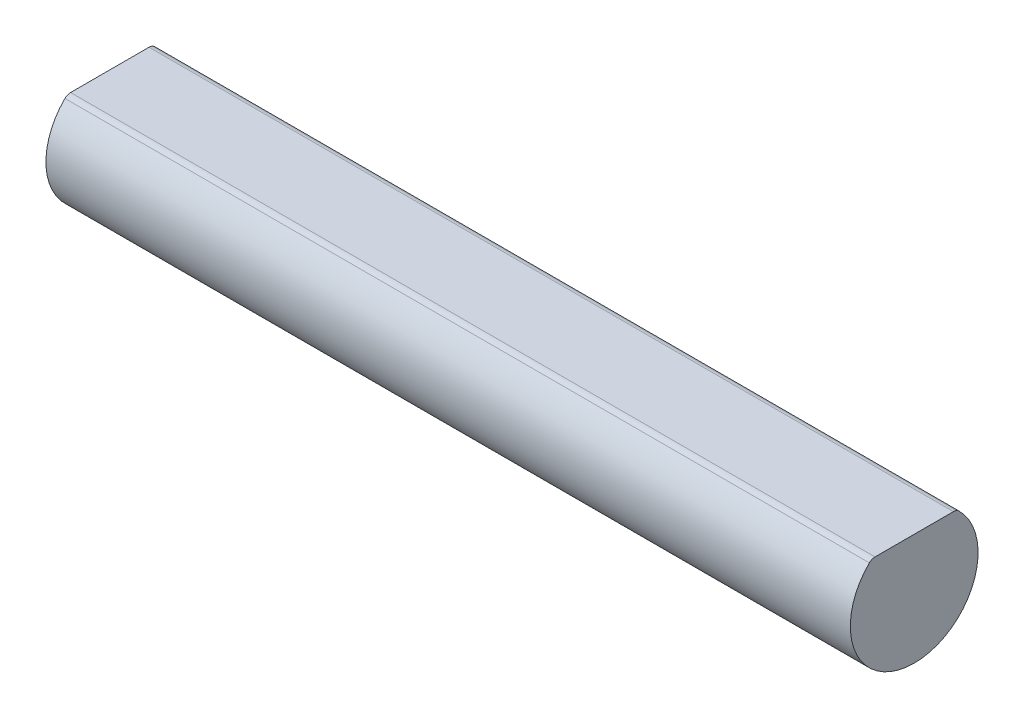
ISO-10303-21;
HEADER;
FILE_DESCRIPTION(('STEP AP214'),'2;1');
FILE_NAME('part.step','',(''),(''),'','','');
FILE_SCHEMA(('AUTOMOTIVE_DESIGN { 1 0 10303 214 1 1 1 1 }'));
ENDSEC;
DATA;
#1=APPLICATION_CONTEXT('core data for automotive mechanical design processes');
#2=APPLICATION_PROTOCOL_DEFINITION('international standard','automotive_design',2000,#1);
#3=PRODUCT_CONTEXT('',#1,'mechanical');
#4=PRODUCT('Part','Part','',(#3));
#5=PRODUCT_RELATED_PRODUCT_CATEGORY('part','',(#4));
#6=PRODUCT_DEFINITION_FORMATION('','',#4);
#7=PRODUCT_DEFINITION_CONTEXT('part definition',#1,'design');
#8=PRODUCT_DEFINITION('design','',#6,#7);
#9=PRODUCT_DEFINITION_SHAPE('','',#8);
#10=(LENGTH_UNIT() NAMED_UNIT(*) SI_UNIT(.MILLI.,.METRE.));
#11=(NAMED_UNIT(*) PLANE_ANGLE_UNIT() SI_UNIT($,.RADIAN.));
#12=(NAMED_UNIT(*) SI_UNIT($,.STERADIAN.) SOLID_ANGLE_UNIT());
#13=UNCERTAINTY_MEASURE_WITH_UNIT(LENGTH_MEASURE(1.E-05),#10,'distance_accuracy_value','');
#14=(GEOMETRIC_REPRESENTATION_CONTEXT(3) GLOBAL_UNCERTAINTY_ASSIGNED_CONTEXT((#13)) GLOBAL_UNIT_ASSIGNED_CONTEXT((#10,
#11,#12)) REPRESENTATION_CONTEXT('',''));
#15=CARTESIAN_POINT('',(0.,0.,0.));
#16=DIRECTION('',(0.,0.,1.));
#17=DIRECTION('',(1.,0.,0.));
#18=AXIS2_PLACEMENT_3D('',#15,#16,#17);
#19=CARTESIAN_POINT('',(100.,0.,0.));
#20=DIRECTION('',(-1.,0.,0.));
#21=DIRECTION('',(0.,0.,1.));
#22=AXIS2_PLACEMENT_3D('',#19,#20,#21);
#23=CYLINDRICAL_SURFACE('',#22,7.94);
#24=CARTESIAN_POINT('',(0.,0.,0.));
#25=DIRECTION('',(1.,0.,0.));
#26=DIRECTION('',(0.,0.,-1.));
#27=AXIS2_PLACEMENT_3D('',#24,#25,#26);
#28=CIRCLE('',#27,7.94);
#29=CARTESIAN_POINT('',(0.,5.65181556195965,5.57678947545904));
#30=VERTEX_POINT('',#29);
#31=CARTESIAN_POINT('',(0.,5.65181556195965,-5.57678947545904));
#32=VERTEX_POINT('',#31);
#33=EDGE_CURVE('E102',#30,#32,#28,.T.);
#34=ORIENTED_EDGE('',*,*,#33,.T.);
#35=DIRECTION('',(-1.,0.,0.));
#36=VECTOR('',#35,1.);
#37=CARTESIAN_POINT('',(100.,5.65181556195965,-5.57678947545904));
#38=LINE('',#37,#36);
#39=CARTESIAN_POINT('',(100.,5.65181556195965,-5.57678947545904));
#40=VERTEX_POINT('',#39);
#41=EDGE_CURVE('E52',#32,#40,#38,.F.);
#42=ORIENTED_EDGE('',*,*,#41,.T.);
#43=CARTESIAN_POINT('',(100.,0.,0.));
#44=DIRECTION('',(1.,0.,0.));
#45=DIRECTION('',(0.,0.,-1.));
#46=AXIS2_PLACEMENT_3D('',#43,#44,#45);
#47=CIRCLE('',#46,7.94);
#48=CARTESIAN_POINT('',(100.,5.65181556195965,5.57678947545904));
#49=VERTEX_POINT('',#48);
#50=EDGE_CURVE('E99',#49,#40,#47,.T.);
#51=ORIENTED_EDGE('',*,*,#50,.F.);
#52=DIRECTION('',(-1.,0.,0.));
#53=VECTOR('',#52,1.);
#54=CARTESIAN_POINT('',(100.,5.65181556195965,5.57678947545904));
#55=LINE('',#54,#53);
#56=EDGE_CURVE('E84',#49,#30,#55,.T.);
#57=ORIENTED_EDGE('',*,*,#56,.T.);
#58=EDGE_LOOP('',(#34,#42,#51,#57));
#59=FACE_BOUND('',#58,.T.);
#60=ADVANCED_FACE('F37',(#59),#23,.T.);
#61=CARTESIAN_POINT('',(100.,0.,0.));
#62=DIRECTION('',(1.,0.,0.));
#63=DIRECTION('',(0.,0.,-1.));
#64=AXIS2_PLACEMENT_3D('',#61,#62,#63);
#65=PLANE('',#64);
#66=ORIENTED_EDGE('',*,*,#50,.T.);
#67=CARTESIAN_POINT('',(100.,4.94,-4.87442304278158));
#68=DIRECTION('',(1.,0.,0.));
#69=DIRECTION('',(0.,0.,-1.));
#70=AXIS2_PLACEMENT_3D('',#67,#68,#69);
#71=CIRCLE('',#70,1.);
#72=CARTESIAN_POINT('',(100.,5.94,-4.87442304278158));
#73=VERTEX_POINT('',#72);
#74=EDGE_CURVE('E11',#40,#73,#71,.T.);
#75=ORIENTED_EDGE('',*,*,#74,.T.);
#76=DIRECTION('',(0.,0.,1.));
#77=VECTOR('',#76,1.);
#78=CARTESIAN_POINT('',(100.,5.94,0.));
#79=LINE('',#78,#77);
#80=CARTESIAN_POINT('',(100.,5.94,4.87442304278158));
#81=VERTEX_POINT('',#80);
#82=EDGE_CURVE('E94',#73,#81,#79,.T.);
#83=ORIENTED_EDGE('',*,*,#82,.T.);
#84=CARTESIAN_POINT('',(100.,4.94,4.87442304278158));
#85=DIRECTION('',(1.,0.,0.));
#86=DIRECTION('',(0.,0.,-1.));
#87=AXIS2_PLACEMENT_3D('',#84,#85,#86);
#88=CIRCLE('',#87,1.);
#89=EDGE_CURVE('E45',#81,#49,#88,.T.);
#90=ORIENTED_EDGE('',*,*,#89,.T.);
#91=EDGE_LOOP('',(#66,#75,#83,#90));
#92=FACE_BOUND('',#91,.T.);
#93=ADVANCED_FACE('F110',(#92),#65,.T.);
#94=CARTESIAN_POINT('',(0.,0.,0.));
#95=DIRECTION('',(1.,0.,0.));
#96=DIRECTION('',(0.,0.,-1.));
#97=AXIS2_PLACEMENT_3D('',#94,#95,#96);
#98=PLANE('',#97);
#99=DIRECTION('',(0.,0.,1.));
#100=VECTOR('',#99,1.);
#101=CARTESIAN_POINT('',(0.,5.94,0.));
#102=LINE('',#101,#100);
#103=CARTESIAN_POINT('',(0.,5.94,-4.87442304278158));
#104=VERTEX_POINT('',#103);
#105=CARTESIAN_POINT('',(0.,5.94,4.87442304278158));
#106=VERTEX_POINT('',#105);
#107=EDGE_CURVE('E92',#104,#106,#102,.T.);
#108=ORIENTED_EDGE('',*,*,#107,.F.);
#109=CARTESIAN_POINT('',(0.,4.94,-4.87442304278158));
#110=DIRECTION('',(1.,0.,0.));
#111=DIRECTION('',(0.,0.,-1.));
#112=AXIS2_PLACEMENT_3D('',#109,#110,#111);
#113=CIRCLE('',#112,1.);
#114=EDGE_CURVE('E76',#104,#32,#113,.F.);
#115=ORIENTED_EDGE('',*,*,#114,.T.);
#116=ORIENTED_EDGE('',*,*,#33,.F.);
#117=CARTESIAN_POINT('',(0.,4.94,4.87442304278158));
#118=DIRECTION('',(1.,0.,0.));
#119=DIRECTION('',(0.,0.,-1.));
#120=AXIS2_PLACEMENT_3D('',#117,#118,#119);
#121=CIRCLE('',#120,1.);
#122=EDGE_CURVE('E85',#30,#106,#121,.F.);
#123=ORIENTED_EDGE('',*,*,#122,.T.);
#124=EDGE_LOOP('',(#108,#115,#116,#123));
#125=FACE_BOUND('',#124,.T.);
#126=ADVANCED_FACE('F97',(#125),#98,.F.);
#127=CARTESIAN_POINT('',(0.,5.94,0.));
#128=DIRECTION('',(0.,1.,0.));
#129=DIRECTION('',(0.,0.,1.));
#130=AXIS2_PLACEMENT_3D('',#127,#128,#129);
#131=PLANE('',#130);
#132=ORIENTED_EDGE('',*,*,#82,.F.);
#133=DIRECTION('',(1.,0.,0.));
#134=VECTOR('',#133,1.);
#135=CARTESIAN_POINT('',(0.,5.94,-4.87442304278158));
#136=LINE('',#135,#134);
#137=EDGE_CURVE('E80',#73,#104,#136,.F.);
#138=ORIENTED_EDGE('',*,*,#137,.T.);
#139=ORIENTED_EDGE('',*,*,#107,.T.);
#140=DIRECTION('',(1.,0.,0.));
#141=VECTOR('',#140,1.);
#142=CARTESIAN_POINT('',(100.,5.94,4.87442304278158));
#143=LINE('',#142,#141);
#144=EDGE_CURVE('E95',#106,#81,#143,.T.);
#145=ORIENTED_EDGE('',*,*,#144,.T.);
#146=EDGE_LOOP('',(#132,#138,#139,#145));
#147=FACE_BOUND('',#146,.T.);
#148=ADVANCED_FACE('F90',(#147),#131,.T.);
#149=CARTESIAN_POINT('',(100.,4.94,-4.87442304278158));
#150=DIRECTION('',(-1.,0.,0.));
#151=DIRECTION('',(0.,0.,1.));
#152=AXIS2_PLACEMENT_3D('',#149,#150,#151);
#153=CYLINDRICAL_SURFACE('',#152,1.);
#154=ORIENTED_EDGE('',*,*,#74,.F.);
#155=ORIENTED_EDGE('',*,*,#41,.F.);
#156=ORIENTED_EDGE('',*,*,#114,.F.);
#157=ORIENTED_EDGE('',*,*,#137,.F.);
#158=EDGE_LOOP('',(#154,#155,#156,#157));
#159=FACE_BOUND('',#158,.T.);
#160=ADVANCED_FACE('F79',(#159),#153,.T.);
#161=CARTESIAN_POINT('',(100.,4.94,4.87442304278158));
#162=DIRECTION('',(-1.,0.,0.));
#163=DIRECTION('',(0.,0.,1.));
#164=AXIS2_PLACEMENT_3D('',#161,#162,#163);
#165=CYLINDRICAL_SURFACE('',#164,1.);
#166=ORIENTED_EDGE('',*,*,#122,.F.);
#167=ORIENTED_EDGE('',*,*,#56,.F.);
#168=ORIENTED_EDGE('',*,*,#89,.F.);
#169=ORIENTED_EDGE('',*,*,#144,.F.);
#170=EDGE_LOOP('',(#166,#167,#168,#169));
#171=FACE_BOUND('',#170,.T.);
#172=ADVANCED_FACE('F39',(#171),#165,.T.);
#173=CLOSED_SHELL('',(#60,#93,#126,#148,#160,#172));
#174=MANIFOLD_SOLID_BREP('B2',#173);
#175=ADVANCED_BREP_SHAPE_REPRESENTATION('',(#18,#174),#14);
#176=SHAPE_DEFINITION_REPRESENTATION(#9,#175);
ENDSEC;
END-ISO-10303-21;
